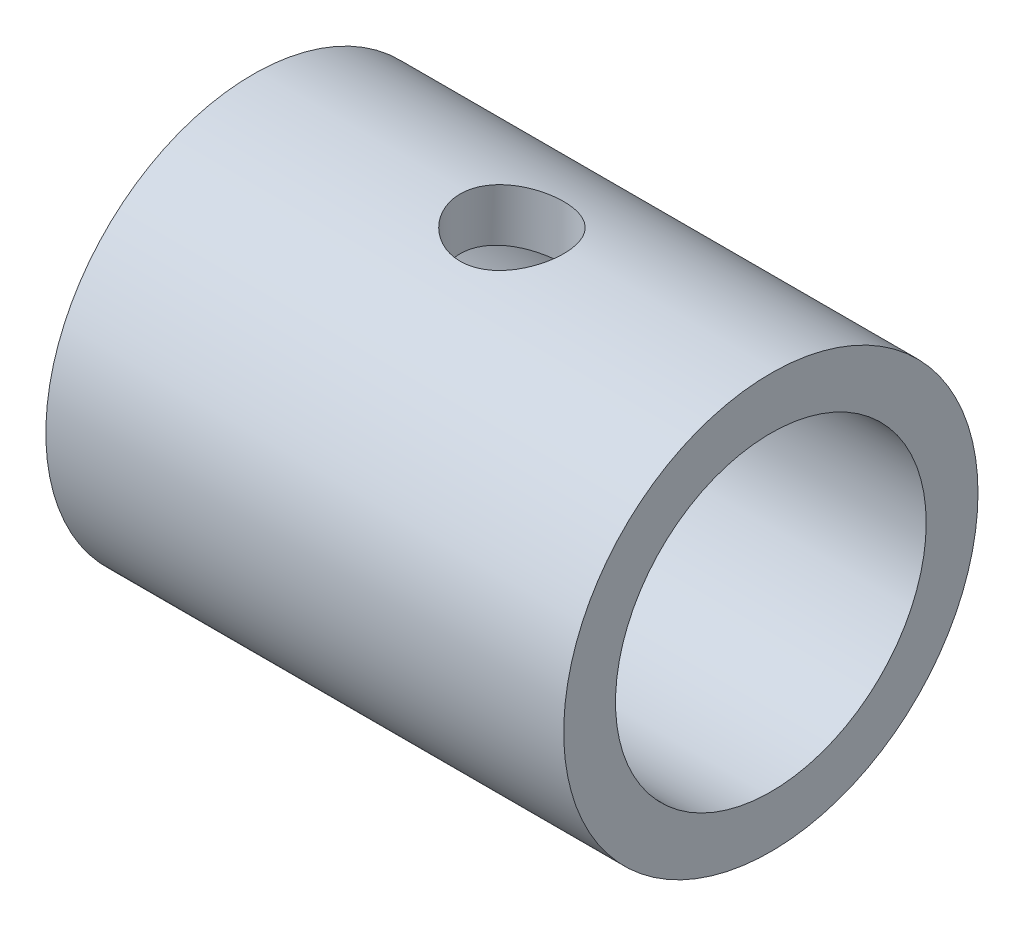
ISO-10303-21;
HEADER;
FILE_DESCRIPTION(('STEP AP214'),'2;1');
FILE_NAME('part.step','',(''),(''),'','','');
FILE_SCHEMA(('AUTOMOTIVE_DESIGN { 1 0 10303 214 1 1 1 1 }'));
ENDSEC;
DATA;
#1=APPLICATION_CONTEXT('core data for automotive mechanical design processes');
#2=APPLICATION_PROTOCOL_DEFINITION('international standard','automotive_design',2000,#1);
#3=PRODUCT_CONTEXT('',#1,'mechanical');
#4=PRODUCT('Part','Part','',(#3));
#5=PRODUCT_RELATED_PRODUCT_CATEGORY('part','',(#4));
#6=PRODUCT_DEFINITION_FORMATION('','',#4);
#7=PRODUCT_DEFINITION_CONTEXT('part definition',#1,'design');
#8=PRODUCT_DEFINITION('design','',#6,#7);
#9=PRODUCT_DEFINITION_SHAPE('','',#8);
#10=(LENGTH_UNIT() NAMED_UNIT(*) SI_UNIT(.MILLI.,.METRE.));
#11=(NAMED_UNIT(*) PLANE_ANGLE_UNIT() SI_UNIT($,.RADIAN.));
#12=(NAMED_UNIT(*) SI_UNIT($,.STERADIAN.) SOLID_ANGLE_UNIT());
#13=UNCERTAINTY_MEASURE_WITH_UNIT(LENGTH_MEASURE(1.E-05),#10,'distance_accuracy_value','');
#14=(GEOMETRIC_REPRESENTATION_CONTEXT(3) GLOBAL_UNCERTAINTY_ASSIGNED_CONTEXT((#13)) GLOBAL_UNIT_ASSIGNED_CONTEXT((#10,
#11,#12)) REPRESENTATION_CONTEXT('',''));
#15=CARTESIAN_POINT('',(0.,0.,0.));
#16=DIRECTION('',(0.,0.,1.));
#17=DIRECTION('',(1.,0.,0.));
#18=AXIS2_PLACEMENT_3D('',#15,#16,#17);
#19=CARTESIAN_POINT('',(10.,0.,0.));
#20=DIRECTION('',(1.,0.,0.));
#21=DIRECTION('',(0.,0.,-1.));
#22=AXIS2_PLACEMENT_3D('',#19,#20,#21);
#23=PLANE('',#22);
#24=CARTESIAN_POINT('',(10.,0.,0.));
#25=DIRECTION('',(1.,0.,0.));
#26=DIRECTION('',(0.,0.,-1.));
#27=AXIS2_PLACEMENT_3D('',#24,#25,#26);
#28=CIRCLE('',#27,8.);
#29=CARTESIAN_POINT('',(10.,0.,-8.));
#30=VERTEX_POINT('',#29);
#31=EDGE_CURVE('E10',#30,#30,#28,.T.);
#32=ORIENTED_EDGE('',*,*,#31,.T.);
#33=EDGE_LOOP('',(#32));
#34=FACE_BOUND('',#33,.T.);
#35=CARTESIAN_POINT('',(10.,0.,0.));
#36=DIRECTION('',(1.,0.,0.));
#37=DIRECTION('',(0.,0.,-1.));
#38=AXIS2_PLACEMENT_3D('',#35,#36,#37);
#39=CIRCLE('',#38,6.);
#40=CARTESIAN_POINT('',(10.,0.,-6.));
#41=VERTEX_POINT('',#40);
#42=EDGE_CURVE('E58',#41,#41,#39,.T.);
#43=ORIENTED_EDGE('',*,*,#42,.F.);
#44=EDGE_LOOP('',(#43));
#45=FACE_BOUND('',#44,.T.);
#46=ADVANCED_FACE('F37',(#34,#45),#23,.T.);
#47=CARTESIAN_POINT('',(-10.,0.,0.));
#48=DIRECTION('',(1.,0.,0.));
#49=DIRECTION('',(0.,0.,-1.));
#50=AXIS2_PLACEMENT_3D('',#47,#48,#49);
#51=PLANE('',#50);
#52=CARTESIAN_POINT('',(-10.,0.,0.));
#53=DIRECTION('',(1.,0.,0.));
#54=DIRECTION('',(0.,0.,-1.));
#55=AXIS2_PLACEMENT_3D('',#52,#53,#54);
#56=CIRCLE('',#55,8.);
#57=CARTESIAN_POINT('',(-10.,0.,-8.));
#58=VERTEX_POINT('',#57);
#59=EDGE_CURVE('E52',#58,#58,#56,.T.);
#60=ORIENTED_EDGE('',*,*,#59,.F.);
#61=EDGE_LOOP('',(#60));
#62=FACE_BOUND('',#61,.T.);
#63=CARTESIAN_POINT('',(-10.,0.,0.));
#64=DIRECTION('',(1.,0.,0.));
#65=DIRECTION('',(0.,0.,-1.));
#66=AXIS2_PLACEMENT_3D('',#63,#64,#65);
#67=CIRCLE('',#66,6.);
#68=CARTESIAN_POINT('',(-10.,0.,-6.));
#69=VERTEX_POINT('',#68);
#70=EDGE_CURVE('E61',#69,#69,#67,.T.);
#71=ORIENTED_EDGE('',*,*,#70,.T.);
#72=EDGE_LOOP('',(#71));
#73=FACE_BOUND('',#72,.T.);
#74=ADVANCED_FACE('F102',(#62,#73),#51,.F.);
#75=CARTESIAN_POINT('',(10.,0.,0.));
#76=DIRECTION('',(-1.,0.,0.));
#77=DIRECTION('',(0.,0.,1.));
#78=AXIS2_PLACEMENT_3D('',#75,#76,#77);
#79=CYLINDRICAL_SURFACE('',#78,8.);
#80=CARTESIAN_POINT('',(0.,-7.74596669241483,2.));
#81=CARTESIAN_POINT('',(0.110440600741261,-7.74596880070288,1.99999686287446));
#82=CARTESIAN_POINT('',(0.220915918942817,-7.74835444811678,1.99082099639812));
#83=CARTESIAN_POINT('',(0.438694062538807,-7.75761489594051,1.95441850037103));
#84=CARTESIAN_POINT('',(0.545995003574548,-7.76449230897304,1.92718136539368));
#85=CARTESIAN_POINT('',(0.754242830549745,-7.7819097967692,1.85559295970563));
#86=CARTESIAN_POINT('',(0.855197724308566,-7.79244514152366,1.81126378228359));
#87=CARTESIAN_POINT('',(1.04824868203191,-7.81598553623007,1.70681691300911));
#88=CARTESIAN_POINT('',(1.14034436966417,-7.82899069102791,1.64669855084855));
#89=CARTESIAN_POINT('',(1.31508931620977,-7.856325730845,1.5109667418495));
#90=CARTESIAN_POINT('',(1.39751488028004,-7.87067678098427,1.43506951016324));
#91=CARTESIAN_POINT('',(1.54860911548827,-7.89890300412235,1.27054565128053));
#92=CARTESIAN_POINT('',(1.6172765004974,-7.9127781325311,1.18191783534425));
#93=CARTESIAN_POINT('',(1.73982037410502,-7.93872332416466,0.992916160863164));
#94=CARTESIAN_POINT('',(1.79347711052917,-7.95076549920474,0.892395660956096));
#95=CARTESIAN_POINT('',(1.88304771532247,-7.97144649540787,0.68341054743421));
#96=CARTESIAN_POINT('',(1.91896420153241,-7.98008581867475,0.574947108633552));
#97=CARTESIAN_POINT('',(1.97131826766287,-7.99283807078544,0.355487007003329));
#98=CARTESIAN_POINT('',(1.98813571546126,-7.99703915075451,0.244586175639181));
#99=CARTESIAN_POINT('',(2.00300670342044,-8.00074875285838,0.0214630554102158));
#100=CARTESIAN_POINT('',(2.00106301776768,-8.00025796877363,-0.0907590356304546));
#101=CARTESIAN_POINT('',(1.97874011979988,-7.99470475962828,-0.310704494344774));
#102=CARTESIAN_POINT('',(1.95877093995691,-7.98974401872699,-0.418472431202134));
#103=CARTESIAN_POINT('',(1.9016229839612,-7.97592669219883,-0.629076494827372));
#104=CARTESIAN_POINT('',(1.86444329169807,-7.96706989918753,-0.731912358740876));
#105=CARTESIAN_POINT('',(1.77359794345035,-7.94630007760716,-0.930813407003613));
#106=CARTESIAN_POINT('',(1.7197863642706,-7.93436015756043,-1.02680901953301));
#107=CARTESIAN_POINT('',(1.59731545670699,-7.90871923047719,-1.20855124468098));
#108=CARTESIAN_POINT('',(1.5286535451515,-7.89501791721992,-1.29429607017101));
#109=CARTESIAN_POINT('',(1.3762330064141,-7.86690971015616,-1.45554807016991));
#110=CARTESIAN_POINT('',(1.29211608612178,-7.85249375620734,-1.5307153581504));
#111=CARTESIAN_POINT('',(1.1123200211678,-7.82492034813365,-1.66595275192604));
#112=CARTESIAN_POINT('',(1.0166403364072,-7.81176295284776,-1.72602215209203));
#113=CARTESIAN_POINT('',(0.815767972680827,-7.78816397465318,-1.82957625804519));
#114=CARTESIAN_POINT('',(0.710531415749444,-7.77773586980576,-1.87297913394098));
#115=CARTESIAN_POINT('',(0.493931625538839,-7.76094912111965,-1.94137124127268));
#116=CARTESIAN_POINT('',(0.382569708813491,-7.75458960648175,-1.96636441310582));
#117=CARTESIAN_POINT('',(0.160032398781503,-7.74684284831312,-1.99666371093214));
#118=CARTESIAN_POINT('',(0.0489297653362969,-7.74532871274918,-2.0024723791357));
#119=CARTESIAN_POINT('',(-0.172657549262526,-7.74709874784831,-1.99561359241244));
#120=CARTESIAN_POINT('',(-0.283142286360992,-7.75038247681013,-1.98294783827904));
#121=CARTESIAN_POINT('',(-0.498491411963765,-7.76125665563648,-1.93994037115013));
#122=CARTESIAN_POINT('',(-0.603418181256674,-7.768775761875,-1.9098912546254));
#123=CARTESIAN_POINT('',(-0.806745166281346,-7.7872057461677,-1.8332944653365));
#124=CARTESIAN_POINT('',(-0.905144607244271,-7.7981170259889,-1.78674483817004));
#125=CARTESIAN_POINT('',(-1.09475302229388,-7.8223690967461,-1.67741653434925));
#126=CARTESIAN_POINT('',(-1.18578307203448,-7.83575334885313,-1.6143374030685));
#127=CARTESIAN_POINT('',(-1.35615069024108,-7.86333666457373,-1.47412058586891));
#128=CARTESIAN_POINT('',(-1.43548633332006,-7.87753586182776,-1.39698058961088));
#129=CARTESIAN_POINT('',(-1.58224883405677,-7.90557922425285,-1.22852544196945));
#130=CARTESIAN_POINT('',(-1.64932805003905,-7.91940561649468,-1.13690390506318));
#131=CARTESIAN_POINT('',(-1.76714869356099,-7.94477773290987,-0.94340536538935));
#132=CARTESIAN_POINT('',(-1.81789097328656,-7.95632357603169,-0.841528897915181));
#133=CARTESIAN_POINT('',(-1.90115682762235,-7.9757609259065,-0.631116403462181));
#134=CARTESIAN_POINT('',(-1.93381142750325,-7.98367864017925,-0.522634762055764));
#135=CARTESIAN_POINT('',(-1.98036826768673,-7.99508234716633,-0.301499520637614));
#136=CARTESIAN_POINT('',(-1.99427412699123,-7.99856919514738,-0.188846730082481));
#137=CARTESIAN_POINT('',(-2.00273517915108,-8.00068338817611,0.034167052886646));
#138=CARTESIAN_POINT('',(-1.99780341819082,-7.99943957759977,0.144507653932043));
#139=CARTESIAN_POINT('',(-1.9699043454113,-7.99251792914887,0.362734992829501));
#140=CARTESIAN_POINT('',(-1.94693756997366,-7.98684022314338,0.470621803561857));
#141=CARTESIAN_POINT('',(-1.88389556045828,-7.97170865707778,0.680342071289548));
#142=CARTESIAN_POINT('',(-1.84391309337124,-7.96227529004785,0.782204989161726));
#143=CARTESIAN_POINT('',(-1.74805884196085,-7.94062577827316,0.977834106083248));
#144=CARTESIAN_POINT('',(-1.69218505465903,-7.92840928277515,1.07159928253127));
#145=CARTESIAN_POINT('',(-1.56456953200773,-7.90214499360574,1.25080385684661));
#146=CARTESIAN_POINT('',(-1.49247971419234,-7.88806033883329,1.33598997659667));
#147=CARTESIAN_POINT('',(-1.33515429604531,-7.85981298114379,1.49323004054701));
#148=CARTESIAN_POINT('',(-1.24991536777767,-7.84565025934604,1.56528065015318));
#149=CARTESIAN_POINT('',(-1.06679717162108,-7.81854951691005,1.69552405294366));
#150=CARTESIAN_POINT('',(-0.968711753269493,-7.80563927346577,1.75343323883276));
#151=CARTESIAN_POINT('',(-0.763889020250362,-7.78287910989656,1.85185379317094));
#152=CARTESIAN_POINT('',(-0.657158067812308,-7.77302696466427,1.8923778195043));
#153=CARTESIAN_POINT('',(-0.458845976329679,-7.75903817501474,1.948845057142));
#154=CARTESIAN_POINT('',(-0.368213671227727,-7.75417326006998,1.96798634119376));
#155=CARTESIAN_POINT('',(-0.185062262004624,-7.7476367716524,1.99356458514354));
#156=CARTESIAN_POINT('',(-0.0925433195111956,-7.74596492578215,2.0000026287435));
#157=CARTESIAN_POINT('',(0.,-7.74596669241483,2.));
#158=B_SPLINE_CURVE_WITH_KNOTS('',3,(#80,#81,#82,#83,#84,#85,#86,#87,#88,#89,#90,#91,#92,#93,
#94,#95,#96,#97,#98,#99,#100,#101,#102,#103,#104,#105,#106,#107,#108,#109,#110,#111,#112,#113,
#114,#115,#116,#117,#118,#119,#120,#121,#122,#123,#124,#125,#126,#127,#128,#129,#130,#131,#132,
#133,#134,#135,#136,#137,#138,#139,#140,#141,#142,#143,#144,#145,#146,#147,#148,#149,#150,#151,
#152,#153,#154,#155,#156,#157),.UNSPECIFIED.,.T.,.F.,(4,2,2,2,2,2,2,2,2,2,2,2,2,2,2,2,2,2,2,2,2,
2,2,2,2,2,2,2,2,2,2,2,2,2,2,2,2,2,4),(0.,0.330981953388909,0.662156593142932,0.992904581732816,
1.32366661404383,1.66099163354381,1.99834817183893,2.34041197118336,2.68242527877674,
3.01751000796277,3.35254518932816,3.68014610151157,4.00776445379829,4.33834299403555,
4.6689790837513,5.00856373257529,5.34816424959841,5.68941145606722,6.03058560103638,
6.36274859809373,6.69488101747041,7.02157924007365,7.34831617137134,7.68146276687326,
8.01466415108035,8.35620264772255,8.69772332575642,9.03673658245543,9.3756843912723,
9.70546756901965,10.0352409390158,10.3632390124777,10.6912784459046,11.0271767726566,
11.3631602525241,11.7054118182895,12.0474137709606,12.3247826174462,12.6021278008238),.UNSPECIFIED.);
#159=CARTESIAN_POINT('',(0.,-7.74596669241483,2.));
#160=VERTEX_POINT('',#159);
#161=EDGE_CURVE('E88',#160,#160,#158,.T.);
#162=ORIENTED_EDGE('',*,*,#161,.T.);
#163=EDGE_LOOP('',(#162));
#164=FACE_BOUND('',#163,.T.);
#165=CARTESIAN_POINT('',(0.,7.74596669241483,2.));
#166=CARTESIAN_POINT('',(-0.110440600741261,7.74596880070288,1.99999686287446));
#167=CARTESIAN_POINT('',(-0.220915918942817,7.74835444811678,1.99082099639812));
#168=CARTESIAN_POINT('',(-0.438694062538807,7.75761489594051,1.95441850037103));
#169=CARTESIAN_POINT('',(-0.545995003574548,7.76449230897304,1.92718136539368));
#170=CARTESIAN_POINT('',(-0.754242830549745,7.7819097967692,1.85559295970563));
#171=CARTESIAN_POINT('',(-0.855197724308566,7.79244514152366,1.81126378228359));
#172=CARTESIAN_POINT('',(-1.04824868203191,7.81598553623007,1.70681691300911));
#173=CARTESIAN_POINT('',(-1.14034436966417,7.82899069102791,1.64669855084855));
#174=CARTESIAN_POINT('',(-1.31508931620977,7.856325730845,1.5109667418495));
#175=CARTESIAN_POINT('',(-1.39751488028004,7.87067678098427,1.43506951016324));
#176=CARTESIAN_POINT('',(-1.54860911548827,7.89890300412235,1.27054565128053));
#177=CARTESIAN_POINT('',(-1.6172765004974,7.9127781325311,1.18191783534425));
#178=CARTESIAN_POINT('',(-1.73982037410502,7.93872332416466,0.992916160863164));
#179=CARTESIAN_POINT('',(-1.79347711052917,7.95076549920474,0.892395660956096));
#180=CARTESIAN_POINT('',(-1.88304771532247,7.97144649540787,0.68341054743421));
#181=CARTESIAN_POINT('',(-1.91896420153241,7.98008581867475,0.574947108633552));
#182=CARTESIAN_POINT('',(-1.97131826766287,7.99283807078544,0.355487007003329));
#183=CARTESIAN_POINT('',(-1.98813571546126,7.99703915075451,0.244586175639181));
#184=CARTESIAN_POINT('',(-2.00300670342044,8.00074875285838,0.0214630554102158));
#185=CARTESIAN_POINT('',(-2.00106301776768,8.00025796877363,-0.0907590356304546));
#186=CARTESIAN_POINT('',(-1.97874011979988,7.99470475962828,-0.310704494344774));
#187=CARTESIAN_POINT('',(-1.95877093995691,7.98974401872699,-0.418472431202134));
#188=CARTESIAN_POINT('',(-1.9016229839612,7.97592669219883,-0.629076494827372));
#189=CARTESIAN_POINT('',(-1.86444329169807,7.96706989918753,-0.731912358740876));
#190=CARTESIAN_POINT('',(-1.77359794345035,7.94630007760716,-0.930813407003613));
#191=CARTESIAN_POINT('',(-1.7197863642706,7.93436015756043,-1.02680901953301));
#192=CARTESIAN_POINT('',(-1.59731545670699,7.90871923047719,-1.20855124468098));
#193=CARTESIAN_POINT('',(-1.5286535451515,7.89501791721992,-1.29429607017101));
#194=CARTESIAN_POINT('',(-1.3762330064141,7.86690971015616,-1.45554807016991));
#195=CARTESIAN_POINT('',(-1.29211608612178,7.85249375620734,-1.5307153581504));
#196=CARTESIAN_POINT('',(-1.1123200211678,7.82492034813365,-1.66595275192604));
#197=CARTESIAN_POINT('',(-1.0166403364072,7.81176295284776,-1.72602215209203));
#198=CARTESIAN_POINT('',(-0.815767972680827,7.78816397465318,-1.82957625804519));
#199=CARTESIAN_POINT('',(-0.710531415749444,7.77773586980576,-1.87297913394098));
#200=CARTESIAN_POINT('',(-0.493931625538839,7.76094912111965,-1.94137124127268));
#201=CARTESIAN_POINT('',(-0.382569708813491,7.75458960648175,-1.96636441310582));
#202=CARTESIAN_POINT('',(-0.160032398781503,7.74684284831312,-1.99666371093214));
#203=CARTESIAN_POINT('',(-0.0489297653362969,7.74532871274918,-2.0024723791357));
#204=CARTESIAN_POINT('',(0.172657549262526,7.74709874784831,-1.99561359241244));
#205=CARTESIAN_POINT('',(0.283142286360992,7.75038247681013,-1.98294783827904));
#206=CARTESIAN_POINT('',(0.498491411963765,7.76125665563648,-1.93994037115013));
#207=CARTESIAN_POINT('',(0.603418181256674,7.768775761875,-1.9098912546254));
#208=CARTESIAN_POINT('',(0.806745166281346,7.7872057461677,-1.8332944653365));
#209=CARTESIAN_POINT('',(0.905144607244271,7.7981170259889,-1.78674483817004));
#210=CARTESIAN_POINT('',(1.09475302229388,7.8223690967461,-1.67741653434925));
#211=CARTESIAN_POINT('',(1.18578307203448,7.83575334885313,-1.6143374030685));
#212=CARTESIAN_POINT('',(1.35615069024108,7.86333666457373,-1.47412058586891));
#213=CARTESIAN_POINT('',(1.43548633332006,7.87753586182776,-1.39698058961088));
#214=CARTESIAN_POINT('',(1.58224883405677,7.90557922425285,-1.22852544196945));
#215=CARTESIAN_POINT('',(1.64932805003905,7.91940561649468,-1.13690390506318));
#216=CARTESIAN_POINT('',(1.76714869356099,7.94477773290987,-0.94340536538935));
#217=CARTESIAN_POINT('',(1.81789097328656,7.95632357603169,-0.841528897915181));
#218=CARTESIAN_POINT('',(1.90115682762235,7.9757609259065,-0.631116403462181));
#219=CARTESIAN_POINT('',(1.93381142750325,7.98367864017925,-0.522634762055764));
#220=CARTESIAN_POINT('',(1.98036826768673,7.99508234716633,-0.301499520637614));
#221=CARTESIAN_POINT('',(1.99427412699123,7.99856919514738,-0.188846730082481));
#222=CARTESIAN_POINT('',(2.00273517915108,8.00068338817611,0.034167052886646));
#223=CARTESIAN_POINT('',(1.99780341819082,7.99943957759977,0.144507653932043));
#224=CARTESIAN_POINT('',(1.9699043454113,7.99251792914887,0.362734992829501));
#225=CARTESIAN_POINT('',(1.94693756997366,7.98684022314338,0.470621803561857));
#226=CARTESIAN_POINT('',(1.88389556045828,7.97170865707778,0.680342071289548));
#227=CARTESIAN_POINT('',(1.84391309337124,7.96227529004785,0.782204989161726));
#228=CARTESIAN_POINT('',(1.74805884196085,7.94062577827316,0.977834106083248));
#229=CARTESIAN_POINT('',(1.69218505465903,7.92840928277515,1.07159928253127));
#230=CARTESIAN_POINT('',(1.56456953200773,7.90214499360574,1.25080385684661));
#231=CARTESIAN_POINT('',(1.49247971419234,7.88806033883329,1.33598997659667));
#232=CARTESIAN_POINT('',(1.33515429604531,7.85981298114379,1.49323004054701));
#233=CARTESIAN_POINT('',(1.24991536777767,7.84565025934604,1.56528065015318));
#234=CARTESIAN_POINT('',(1.06679717162108,7.81854951691005,1.69552405294366));
#235=CARTESIAN_POINT('',(0.968711753269493,7.80563927346577,1.75343323883276));
#236=CARTESIAN_POINT('',(0.763889020250362,7.78287910989656,1.85185379317094));
#237=CARTESIAN_POINT('',(0.657158067812308,7.77302696466427,1.8923778195043));
#238=CARTESIAN_POINT('',(0.458845976329679,7.75903817501474,1.948845057142));
#239=CARTESIAN_POINT('',(0.368213671227727,7.75417326006998,1.96798634119376));
#240=CARTESIAN_POINT('',(0.185062262004624,7.7476367716524,1.99356458514354));
#241=CARTESIAN_POINT('',(0.0925433195111956,7.74596492578215,2.0000026287435));
#242=CARTESIAN_POINT('',(0.,7.74596669241483,2.));
#243=B_SPLINE_CURVE_WITH_KNOTS('',3,(#165,#166,#167,#168,#169,#170,#171,#172,#173,#174,#175,
#176,#177,#178,#179,#180,#181,#182,#183,#184,#185,#186,#187,#188,#189,#190,#191,#192,#193,#194,
#195,#196,#197,#198,#199,#200,#201,#202,#203,#204,#205,#206,#207,#208,#209,#210,#211,#212,#213,
#214,#215,#216,#217,#218,#219,#220,#221,#222,#223,#224,#225,#226,#227,#228,#229,#230,#231,#232,
#233,#234,#235,#236,#237,#238,#239,#240,#241,#242),.UNSPECIFIED.,.T.,.F.,(4,2,2,2,2,2,2,2,2,2,2,
2,2,2,2,2,2,2,2,2,2,2,2,2,2,2,2,2,2,2,2,2,2,2,2,2,2,2,4),(0.,0.330981953388909,
0.662156593142932,0.992904581732816,1.32366661404383,1.66099163354381,1.99834817183893,
2.34041197118336,2.68242527877674,3.01751000796277,3.35254518932816,3.68014610151157,
4.00776445379829,4.33834299403555,4.6689790837513,5.00856373257529,5.34816424959841,
5.68941145606722,6.03058560103638,6.36274859809373,6.69488101747041,7.02157924007365,
7.34831617137134,7.68146276687326,8.01466415108035,8.35620264772255,8.69772332575642,
9.03673658245543,9.3756843912723,9.70546756901965,10.0352409390158,10.3632390124777,
10.6912784459046,11.0271767726566,11.3631602525241,11.7054118182895,12.0474137709606,
12.3247826174462,12.6021278008238),.UNSPECIFIED.);
#244=CARTESIAN_POINT('',(0.,7.74596669241483,2.));
#245=VERTEX_POINT('',#244);
#246=EDGE_CURVE('E82',#245,#245,#243,.T.);
#247=ORIENTED_EDGE('',*,*,#246,.T.);
#248=EDGE_LOOP('',(#247));
#249=FACE_BOUND('',#248,.T.);
#250=ORIENTED_EDGE('',*,*,#31,.F.);
#251=EDGE_LOOP('',(#250));
#252=FACE_BOUND('',#251,.T.);
#253=ORIENTED_EDGE('',*,*,#59,.T.);
#254=EDGE_LOOP('',(#253));
#255=FACE_BOUND('',#254,.T.);
#256=ADVANCED_FACE('F39',(#164,#249,#252,#255),#79,.T.);
#257=CARTESIAN_POINT('',(10.,0.,0.));
#258=DIRECTION('',(-1.,0.,0.));
#259=DIRECTION('',(0.,0.,1.));
#260=AXIS2_PLACEMENT_3D('',#257,#258,#259);
#261=CYLINDRICAL_SURFACE('',#260,6.);
#262=CARTESIAN_POINT('',(0.,-5.65685424949238,2.));
#263=CARTESIAN_POINT('',(0.108936349672144,-5.65685389060868,2.00000051589543));
#264=CARTESIAN_POINT('',(0.217869599647185,-5.66003538581715,1.99106956737104));
#265=CARTESIAN_POINT('',(0.432508841988498,-5.6723514816251,1.95570226337762));
#266=CARTESIAN_POINT('',(0.538214299744939,-5.68148706284377,1.92926302433679));
#267=CARTESIAN_POINT('',(0.743253785994576,-5.70456407377583,1.85991097136981));
#268=CARTESIAN_POINT('',(0.842599858885432,-5.71849607942643,1.81703044280649));
#269=CARTESIAN_POINT('',(1.03272009709592,-5.74958244020649,1.71612325688276));
#270=CARTESIAN_POINT('',(1.12349236510726,-5.76673750607225,1.65809325772037));
#271=CARTESIAN_POINT('',(1.29743992467663,-5.80308978814946,1.52610229288576));
#272=CARTESIAN_POINT('',(1.38023085734346,-5.82233789689288,1.45164868275584));
#273=CARTESIAN_POINT('',(1.53241360244928,-5.86027729602006,1.28997533442879));
#274=CARTESIAN_POINT('',(1.60180326316474,-5.87896849657923,1.20275355010475));
#275=CARTESIAN_POINT('',(1.72695779465919,-5.91427733843598,1.01520901593002));
#276=CARTESIAN_POINT('',(1.78231994123592,-5.93082815403211,0.91460382244905));
#277=CARTESIAN_POINT('',(1.87518317025502,-5.95939173541966,0.704862445974947));
#278=CARTESIAN_POINT('',(1.91268906635381,-5.97140572406004,0.595728571374423));
#279=CARTESIAN_POINT('',(1.96747170926479,-5.98918150863813,0.376057634866988));
#280=CARTESIAN_POINT('',(1.98540689251401,-5.99514629555118,0.265701509705936));
#281=CARTESIAN_POINT('',(2.00263258672132,-6.00087216436496,0.0433957496481787));
#282=CARTESIAN_POINT('',(2.00192790330482,-6.00063484525791,-0.068553467087793));
#283=CARTESIAN_POINT('',(1.98231149086794,-5.99412079237463,-0.286207030387629));
#284=CARTESIAN_POINT('',(1.96411494305102,-5.98808129510235,-0.391984097183313));
#285=CARTESIAN_POINT('',(1.91121403803905,-5.97093934679463,-0.598886877644343));
#286=CARTESIAN_POINT('',(1.87650856204035,-5.95983655262363,-0.700012275558432));
#287=CARTESIAN_POINT('',(1.79115736538788,-5.93351340586448,-0.896304949683946));
#288=CARTESIAN_POINT('',(1.74030812290698,-5.91824085048031,-0.99137644193769));
#289=CARTESIAN_POINT('',(1.62428058910269,-5.88516786077838,-1.17184865105465));
#290=CARTESIAN_POINT('',(1.55909831334474,-5.86736672402934,-1.25724666877068));
#291=CARTESIAN_POINT('',(1.4126512130806,-5.83012383699793,-1.42020173310262));
#292=CARTESIAN_POINT('',(1.33077368431704,-5.81064430337755,-1.49720031413054));
#293=CARTESIAN_POINT('',(1.15510254854676,-5.77294670497801,-1.63655451919635));
#294=CARTESIAN_POINT('',(1.06130710854391,-5.75472883491231,-1.69890788656309));
#295=CARTESIAN_POINT('',(0.86269274879312,-5.72141050242224,-1.80797491007149));
#296=CARTESIAN_POINT('',(0.757735737364452,-5.70635818569496,-1.85445292724268));
#297=CARTESIAN_POINT('',(0.540857211571164,-5.68163301648769,-1.92888638653867));
#298=CARTESIAN_POINT('',(0.428938637587508,-5.67195790974185,-1.95684959149499));
#299=CARTESIAN_POINT('',(0.206723289176851,-5.6595927263117,-1.99232256419504));
#300=CARTESIAN_POINT('',(0.0965811505026874,-5.65660720637512,-2.00069819101527));
#301=CARTESIAN_POINT('',(-0.123552298228214,-5.65713344118369,-1.99921087781944));
#302=CARTESIAN_POINT('',(-0.233543632047977,-5.66064401583629,-1.98935125045353));
#303=CARTESIAN_POINT('',(-0.446313931423819,-5.67347236180599,-1.95245130310462));
#304=CARTESIAN_POINT('',(-0.549210860301682,-5.68258650881681,-1.92601278796137));
#305=CARTESIAN_POINT('',(-0.749087212478369,-5.70537107342046,-1.85742772512093));
#306=CARTESIAN_POINT('',(-0.846065583181561,-5.71904229869679,-1.81527839272684));
#307=CARTESIAN_POINT('',(-1.034760841694,-5.74993755191574,-1.71494868147787));
#308=CARTESIAN_POINT('',(-1.1262132852836,-5.76726051331256,-1.65630223671699));
#309=CARTESIAN_POINT('',(-1.29829210476744,-5.8033153746193,-1.52517126111512));
#310=CARTESIAN_POINT('',(-1.37891527732244,-5.82204768887589,-1.45268265099756));
#311=CARTESIAN_POINT('',(-1.53105596818128,-5.85990077275698,-1.29178341180065));
#312=CARTESIAN_POINT('',(-1.6019487800377,-5.87899687155793,-1.2027745410933));
#313=CARTESIAN_POINT('',(-1.72783228469609,-5.91453703226217,-1.01365458280051));
#314=CARTESIAN_POINT('',(-1.78282354232485,-5.93098118835389,-0.913543889729104));
#315=CARTESIAN_POINT('',(-1.87484020972343,-5.95928811621206,-0.705559724864591));
#316=CARTESIAN_POINT('',(-1.91198255429613,-5.97118060009062,-0.597742246642393));
#317=CARTESIAN_POINT('',(-1.96745548412021,-5.98917221675549,-0.376916931692033));
#318=CARTESIAN_POINT('',(-1.985792859761,-5.99527344068037,-0.263910983907779));
#319=CARTESIAN_POINT('',(-2.00252415521128,-6.00083726472513,-0.0416306717200817));
#320=CARTESIAN_POINT('',(-2.00181490786475,-6.00059840178878,0.0675694478400368));
#321=CARTESIAN_POINT('',(-1.98268538370718,-5.99424393038796,0.284222290000347));
#322=CARTESIAN_POINT('',(-1.96426654369446,-5.98812879867152,0.391675153638113));
#323=CARTESIAN_POINT('',(-1.91083553084807,-5.97081829908825,0.600084238864118));
#324=CARTESIAN_POINT('',(-1.87609156929413,-5.95970516722297,0.701116541825578));
#325=CARTESIAN_POINT('',(-1.79124493780569,-5.9335432140899,0.895956701879591));
#326=CARTESIAN_POINT('',(-1.74113948960597,-5.91849368096033,0.989763248284864));
#327=CARTESIAN_POINT('',(-1.62486097579599,-5.88531737655762,1.17126803261757));
#328=CARTESIAN_POINT('',(-1.55816262923672,-5.86709744983853,1.25861250311521));
#329=CARTESIAN_POINT('',(-1.41148521768761,-5.82985977583759,1.42116205254485));
#330=CARTESIAN_POINT('',(-1.33150191547454,-5.81084177546194,1.49636324324918));
#331=CARTESIAN_POINT('',(-1.1567812888261,-5.77326559651196,1.63548361766623));
#332=CARTESIAN_POINT('',(-1.06158897804672,-5.75475455977261,1.6988459319958));
#333=CARTESIAN_POINT('',(-0.861331146194442,-5.72120386646031,1.80862868660223));
#334=CARTESIAN_POINT('',(-0.756268213940671,-5.70616330322499,1.85505355363895));
#335=CARTESIAN_POINT('',(-0.544076351968736,-5.68202668413029,1.92768765640833));
#336=CARTESIAN_POINT('',(-0.437255472949268,-5.67269265714364,1.95471581829904));
#337=CARTESIAN_POINT('',(-0.220287899066597,-5.66010767079036,1.99086864029853));
#338=CARTESIAN_POINT('',(-0.110142365178582,-5.65685461234922,1.99999947839318));
#339=CARTESIAN_POINT('',(0.,-5.65685424949238,2.));
#340=B_SPLINE_CURVE_WITH_KNOTS('',3,(#262,#263,#264,#265,#266,#267,#268,#269,#270,#271,#272,
#273,#274,#275,#276,#277,#278,#279,#280,#281,#282,#283,#284,#285,#286,#287,#288,#289,#290,#291,
#292,#293,#294,#295,#296,#297,#298,#299,#300,#301,#302,#303,#304,#305,#306,#307,#308,#309,#310,
#311,#312,#313,#314,#315,#316,#317,#318,#319,#320,#321,#322,#323,#324,#325,#326,#327,#328,#329,
#330,#331,#332,#333,#334,#335,#336,#337,#338,#339),.UNSPECIFIED.,.T.,.F.,(4,2,2,2,2,2,2,2,2,2,2,
2,2,2,2,2,2,2,2,2,2,2,2,2,2,2,2,2,2,2,2,2,2,2,2,2,2,2,4),(0.,0.326401169598712,
0.652856110030327,0.978673255001655,1.30456233237088,1.64202674855136,1.97954530343976,
2.32587012287314,2.67210152773578,3.00628637529868,3.34038506604654,3.66138009651138,
3.98239688378473,4.3076330972067,4.63295983748044,4.97360348727835,5.31429959224212,
5.65985279686111,6.00526102713231,6.33508582728879,6.66485071674467,6.98328791537552,
7.30178158293891,7.6303771547143,7.95906971324254,8.30357616342185,8.64807037515064,
8.99027582381703,9.33235766008313,9.6583616935527,9.98433928019562,10.3051391208086,
10.6259970152648,10.9587103904127,11.2915300886526,11.6373780547229,11.9831355653373,
12.3132642432538,12.6432789438093),.UNSPECIFIED.);
#341=CARTESIAN_POINT('',(0.,-5.65685424949238,2.));
#342=VERTEX_POINT('',#341);
#343=EDGE_CURVE('E42',#342,#342,#340,.T.);
#344=ORIENTED_EDGE('',*,*,#343,.F.);
#345=EDGE_LOOP('',(#344));
#346=FACE_BOUND('',#345,.T.);
#347=CARTESIAN_POINT('',(0.,5.65685424949238,2.));
#348=CARTESIAN_POINT('',(-0.108936349672144,5.65685389060868,2.00000051589543));
#349=CARTESIAN_POINT('',(-0.217869599647185,5.66003538581715,1.99106956737104));
#350=CARTESIAN_POINT('',(-0.432508841988498,5.6723514816251,1.95570226337762));
#351=CARTESIAN_POINT('',(-0.538214299744939,5.68148706284377,1.92926302433679));
#352=CARTESIAN_POINT('',(-0.743253785994576,5.70456407377583,1.85991097136981));
#353=CARTESIAN_POINT('',(-0.842599858885432,5.71849607942643,1.81703044280649));
#354=CARTESIAN_POINT('',(-1.03272009709592,5.74958244020649,1.71612325688276));
#355=CARTESIAN_POINT('',(-1.12349236510726,5.76673750607225,1.65809325772037));
#356=CARTESIAN_POINT('',(-1.29743992467663,5.80308978814946,1.52610229288576));
#357=CARTESIAN_POINT('',(-1.38023085734346,5.82233789689288,1.45164868275584));
#358=CARTESIAN_POINT('',(-1.53241360244928,5.86027729602006,1.28997533442879));
#359=CARTESIAN_POINT('',(-1.60180326316474,5.87896849657923,1.20275355010475));
#360=CARTESIAN_POINT('',(-1.72695779465919,5.91427733843598,1.01520901593002));
#361=CARTESIAN_POINT('',(-1.78231994123592,5.93082815403211,0.91460382244905));
#362=CARTESIAN_POINT('',(-1.87518317025502,5.95939173541966,0.704862445974947));
#363=CARTESIAN_POINT('',(-1.91268906635381,5.97140572406004,0.595728571374423));
#364=CARTESIAN_POINT('',(-1.96747170926479,5.98918150863813,0.376057634866988));
#365=CARTESIAN_POINT('',(-1.98540689251401,5.99514629555118,0.265701509705936));
#366=CARTESIAN_POINT('',(-2.00263258672132,6.00087216436496,0.0433957496481787));
#367=CARTESIAN_POINT('',(-2.00192790330482,6.00063484525791,-0.068553467087793));
#368=CARTESIAN_POINT('',(-1.98231149086794,5.99412079237463,-0.286207030387629));
#369=CARTESIAN_POINT('',(-1.96411494305102,5.98808129510235,-0.391984097183313));
#370=CARTESIAN_POINT('',(-1.91121403803905,5.97093934679463,-0.598886877644343));
#371=CARTESIAN_POINT('',(-1.87650856204035,5.95983655262363,-0.700012275558432));
#372=CARTESIAN_POINT('',(-1.79115736538788,5.93351340586448,-0.896304949683946));
#373=CARTESIAN_POINT('',(-1.74030812290698,5.91824085048031,-0.99137644193769));
#374=CARTESIAN_POINT('',(-1.62428058910269,5.88516786077838,-1.17184865105465));
#375=CARTESIAN_POINT('',(-1.55909831334474,5.86736672402934,-1.25724666877068));
#376=CARTESIAN_POINT('',(-1.4126512130806,5.83012383699793,-1.42020173310262));
#377=CARTESIAN_POINT('',(-1.33077368431704,5.81064430337755,-1.49720031413054));
#378=CARTESIAN_POINT('',(-1.15510254854676,5.77294670497801,-1.63655451919635));
#379=CARTESIAN_POINT('',(-1.06130710854391,5.75472883491231,-1.69890788656309));
#380=CARTESIAN_POINT('',(-0.86269274879312,5.72141050242224,-1.80797491007149));
#381=CARTESIAN_POINT('',(-0.757735737364452,5.70635818569496,-1.85445292724268));
#382=CARTESIAN_POINT('',(-0.540857211571164,5.68163301648769,-1.92888638653867));
#383=CARTESIAN_POINT('',(-0.428938637587508,5.67195790974185,-1.95684959149499));
#384=CARTESIAN_POINT('',(-0.206723289176851,5.6595927263117,-1.99232256419504));
#385=CARTESIAN_POINT('',(-0.0965811505026874,5.65660720637512,-2.00069819101527));
#386=CARTESIAN_POINT('',(0.123552298228214,5.65713344118369,-1.99921087781944));
#387=CARTESIAN_POINT('',(0.233543632047977,5.66064401583629,-1.98935125045353));
#388=CARTESIAN_POINT('',(0.446313931423819,5.67347236180599,-1.95245130310462));
#389=CARTESIAN_POINT('',(0.549210860301682,5.68258650881681,-1.92601278796137));
#390=CARTESIAN_POINT('',(0.749087212478369,5.70537107342046,-1.85742772512093));
#391=CARTESIAN_POINT('',(0.846065583181561,5.71904229869679,-1.81527839272684));
#392=CARTESIAN_POINT('',(1.034760841694,5.74993755191574,-1.71494868147787));
#393=CARTESIAN_POINT('',(1.1262132852836,5.76726051331256,-1.65630223671699));
#394=CARTESIAN_POINT('',(1.29829210476744,5.8033153746193,-1.52517126111512));
#395=CARTESIAN_POINT('',(1.37891527732244,5.82204768887589,-1.45268265099756));
#396=CARTESIAN_POINT('',(1.53105596818128,5.85990077275698,-1.29178341180065));
#397=CARTESIAN_POINT('',(1.6019487800377,5.87899687155793,-1.2027745410933));
#398=CARTESIAN_POINT('',(1.72783228469609,5.91453703226217,-1.01365458280051));
#399=CARTESIAN_POINT('',(1.78282354232485,5.93098118835389,-0.913543889729104));
#400=CARTESIAN_POINT('',(1.87484020972343,5.95928811621206,-0.705559724864591));
#401=CARTESIAN_POINT('',(1.91198255429613,5.97118060009062,-0.597742246642393));
#402=CARTESIAN_POINT('',(1.96745548412021,5.98917221675549,-0.376916931692033));
#403=CARTESIAN_POINT('',(1.985792859761,5.99527344068037,-0.263910983907779));
#404=CARTESIAN_POINT('',(2.00252415521128,6.00083726472513,-0.0416306717200817));
#405=CARTESIAN_POINT('',(2.00181490786475,6.00059840178878,0.0675694478400368));
#406=CARTESIAN_POINT('',(1.98268538370718,5.99424393038796,0.284222290000347));
#407=CARTESIAN_POINT('',(1.96426654369446,5.98812879867152,0.391675153638113));
#408=CARTESIAN_POINT('',(1.91083553084807,5.97081829908825,0.600084238864118));
#409=CARTESIAN_POINT('',(1.87609156929413,5.95970516722297,0.701116541825578));
#410=CARTESIAN_POINT('',(1.79124493780569,5.9335432140899,0.895956701879591));
#411=CARTESIAN_POINT('',(1.74113948960597,5.91849368096033,0.989763248284864));
#412=CARTESIAN_POINT('',(1.62486097579599,5.88531737655762,1.17126803261757));
#413=CARTESIAN_POINT('',(1.55816262923672,5.86709744983853,1.25861250311521));
#414=CARTESIAN_POINT('',(1.41148521768761,5.82985977583759,1.42116205254485));
#415=CARTESIAN_POINT('',(1.33150191547454,5.81084177546194,1.49636324324918));
#416=CARTESIAN_POINT('',(1.1567812888261,5.77326559651196,1.63548361766623));
#417=CARTESIAN_POINT('',(1.06158897804672,5.75475455977261,1.6988459319958));
#418=CARTESIAN_POINT('',(0.861331146194442,5.72120386646031,1.80862868660223));
#419=CARTESIAN_POINT('',(0.756268213940671,5.70616330322499,1.85505355363895));
#420=CARTESIAN_POINT('',(0.544076351968736,5.68202668413029,1.92768765640833));
#421=CARTESIAN_POINT('',(0.437255472949268,5.67269265714364,1.95471581829904));
#422=CARTESIAN_POINT('',(0.220287899066597,5.66010767079036,1.99086864029853));
#423=CARTESIAN_POINT('',(0.110142365178582,5.65685461234922,1.99999947839318));
#424=CARTESIAN_POINT('',(0.,5.65685424949238,2.));
#425=B_SPLINE_CURVE_WITH_KNOTS('',3,(#347,#348,#349,#350,#351,#352,#353,#354,#355,#356,#357,
#358,#359,#360,#361,#362,#363,#364,#365,#366,#367,#368,#369,#370,#371,#372,#373,#374,#375,#376,
#377,#378,#379,#380,#381,#382,#383,#384,#385,#386,#387,#388,#389,#390,#391,#392,#393,#394,#395,
#396,#397,#398,#399,#400,#401,#402,#403,#404,#405,#406,#407,#408,#409,#410,#411,#412,#413,#414,
#415,#416,#417,#418,#419,#420,#421,#422,#423,#424),.UNSPECIFIED.,.T.,.F.,(4,2,2,2,2,2,2,2,2,2,2,
2,2,2,2,2,2,2,2,2,2,2,2,2,2,2,2,2,2,2,2,2,2,2,2,2,2,2,4),(0.,0.326401169598712,
0.652856110030327,0.978673255001655,1.30456233237088,1.64202674855136,1.97954530343976,
2.32587012287314,2.67210152773578,3.00628637529868,3.34038506604654,3.66138009651138,
3.98239688378473,4.3076330972067,4.63295983748044,4.97360348727835,5.31429959224212,
5.65985279686111,6.00526102713231,6.33508582728879,6.66485071674467,6.98328791537552,
7.30178158293891,7.6303771547143,7.95906971324254,8.30357616342185,8.64807037515064,
8.99027582381703,9.33235766008313,9.6583616935527,9.98433928019562,10.3051391208086,
10.6259970152648,10.9587103904127,11.2915300886526,11.6373780547229,11.9831355653373,
12.3132642432538,12.6432789438093),.UNSPECIFIED.);
#426=CARTESIAN_POINT('',(0.,5.65685424949238,2.));
#427=VERTEX_POINT('',#426);
#428=EDGE_CURVE('E63',#427,#427,#425,.T.);
#429=ORIENTED_EDGE('',*,*,#428,.F.);
#430=EDGE_LOOP('',(#429));
#431=FACE_BOUND('',#430,.T.);
#432=ORIENTED_EDGE('',*,*,#42,.T.);
#433=EDGE_LOOP('',(#432));
#434=FACE_BOUND('',#433,.T.);
#435=ORIENTED_EDGE('',*,*,#70,.F.);
#436=EDGE_LOOP('',(#435));
#437=FACE_BOUND('',#436,.T.);
#438=ADVANCED_FACE('F69',(#346,#431,#434,#437),#261,.F.);
#439=CARTESIAN_POINT('',(0.,-10.,0.));
#440=DIRECTION('',(0.,1.,0.));
#441=DIRECTION('',(0.,0.,1.));
#442=AXIS2_PLACEMENT_3D('',#439,#440,#441);
#443=CYLINDRICAL_SURFACE('',#442,2.);
#444=ORIENTED_EDGE('',*,*,#428,.T.);
#445=EDGE_LOOP('',(#444));
#446=FACE_BOUND('',#445,.T.);
#447=ORIENTED_EDGE('',*,*,#246,.F.);
#448=EDGE_LOOP('',(#447));
#449=FACE_BOUND('',#448,.T.);
#450=ADVANCED_FACE('F75',(#446,#449),#443,.F.);
#451=ORIENTED_EDGE('',*,*,#343,.T.);
#452=EDGE_LOOP('',(#451));
#453=FACE_BOUND('',#452,.T.);
#454=ORIENTED_EDGE('',*,*,#161,.F.);
#455=EDGE_LOOP('',(#454));
#456=FACE_BOUND('',#455,.T.);
#457=ADVANCED_FACE('F72',(#453,#456),#443,.F.);
#458=CLOSED_SHELL('',(#46,#74,#256,#438,#450,#457));
#459=MANIFOLD_SOLID_BREP('B2',#458);
#460=ADVANCED_BREP_SHAPE_REPRESENTATION('',(#18,#459),#14);
#461=SHAPE_DEFINITION_REPRESENTATION(#9,#460);
ENDSEC;
END-ISO-10303-21;
